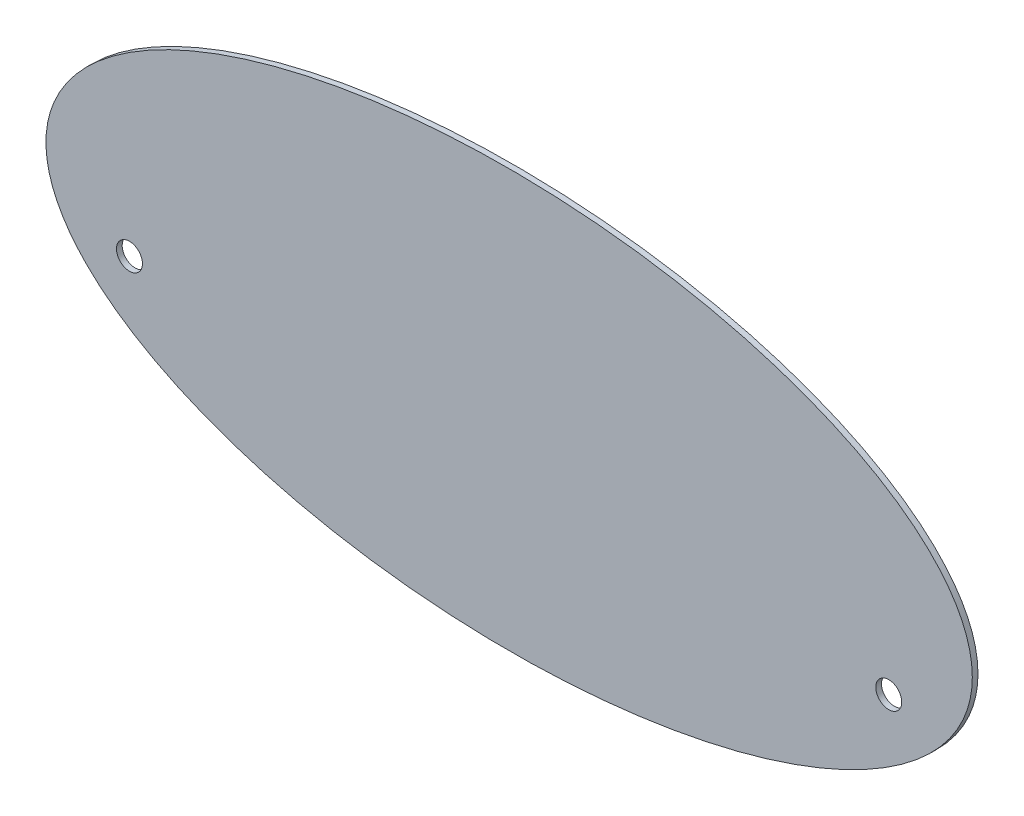
ISO-10303-21;
HEADER;
FILE_DESCRIPTION(('STEP AP214'),'2;1');
FILE_NAME('part.step','',(''),(''),'','','');
FILE_SCHEMA(('AUTOMOTIVE_DESIGN { 1 0 10303 214 1 1 1 1 }'));
ENDSEC;
DATA;
#1=APPLICATION_CONTEXT('core data for automotive mechanical design processes');
#2=APPLICATION_PROTOCOL_DEFINITION('international standard','automotive_design',2000,#1);
#3=PRODUCT_CONTEXT('',#1,'mechanical');
#4=PRODUCT('Part','Part','',(#3));
#5=PRODUCT_RELATED_PRODUCT_CATEGORY('part','',(#4));
#6=PRODUCT_DEFINITION_FORMATION('','',#4);
#7=PRODUCT_DEFINITION_CONTEXT('part definition',#1,'design');
#8=PRODUCT_DEFINITION('design','',#6,#7);
#9=PRODUCT_DEFINITION_SHAPE('','',#8);
#10=(LENGTH_UNIT() NAMED_UNIT(*) SI_UNIT(.MILLI.,.METRE.));
#11=(NAMED_UNIT(*) PLANE_ANGLE_UNIT() SI_UNIT($,.RADIAN.));
#12=(NAMED_UNIT(*) SI_UNIT($,.STERADIAN.) SOLID_ANGLE_UNIT());
#13=UNCERTAINTY_MEASURE_WITH_UNIT(LENGTH_MEASURE(1.E-05),#10,'distance_accuracy_value','');
#14=(GEOMETRIC_REPRESENTATION_CONTEXT(3) GLOBAL_UNCERTAINTY_ASSIGNED_CONTEXT((#13)) GLOBAL_UNIT_ASSIGNED_CONTEXT((#10,
#11,#12)) REPRESENTATION_CONTEXT('',''));
#15=CARTESIAN_POINT('',(0.,0.,0.));
#16=DIRECTION('',(0.,0.,1.));
#17=DIRECTION('',(1.,0.,0.));
#18=AXIS2_PLACEMENT_3D('',#15,#16,#17);
#19=CARTESIAN_POINT('',(0.,0.,3.));
#20=DIRECTION('',(0.,0.,1.));
#21=DIRECTION('',(1.,0.,0.));
#22=AXIS2_PLACEMENT_3D('',#19,#20,#21);
#23=ELLIPSE('',#22,244.,110.);
#24=DIRECTION('',(0.,0.,-1.));
#25=VECTOR('',#24,1.);
#26=SURFACE_OF_LINEAR_EXTRUSION('',#23,#25);
#27=CARTESIAN_POINT('',(244.,0.,3.));
#28=VERTEX_POINT('',#27);
#29=EDGE_CURVE('E10',#28,#28,#23,.T.);
#30=ORIENTED_EDGE('',*,*,#29,.F.);
#31=EDGE_LOOP('',(#30));
#32=FACE_BOUND('',#31,.T.);
#33=CARTESIAN_POINT('',(0.,0.,0.));
#34=DIRECTION('',(0.,0.,1.));
#35=DIRECTION('',(1.,0.,0.));
#36=AXIS2_PLACEMENT_3D('',#33,#34,#35);
#37=ELLIPSE('',#36,244.,110.);
#38=CARTESIAN_POINT('',(244.,0.,0.));
#39=VERTEX_POINT('',#38);
#40=EDGE_CURVE('E41',#39,#39,#37,.T.);
#41=ORIENTED_EDGE('',*,*,#40,.T.);
#42=EDGE_LOOP('',(#41));
#43=FACE_BOUND('',#42,.T.);
#44=ADVANCED_FACE('F33',(#32,#43),#26,.F.);
#45=CARTESIAN_POINT('',(0.,0.,3.));
#46=DIRECTION('',(0.,0.,1.));
#47=DIRECTION('',(1.,0.,0.));
#48=AXIS2_PLACEMENT_3D('',#45,#46,#47);
#49=PLANE('',#48);
#50=CARTESIAN_POINT('',(-200.,-30.,3.));
#51=DIRECTION('',(0.,0.,1.));
#52=DIRECTION('',(1.,0.,0.));
#53=AXIS2_PLACEMENT_3D('',#50,#51,#52);
#54=CIRCLE('',#53,6.83635541999999);
#55=CARTESIAN_POINT('',(-193.16364458,-30.,3.));
#56=VERTEX_POINT('',#55);
#57=EDGE_CURVE('E52',#56,#56,#54,.T.);
#58=ORIENTED_EDGE('',*,*,#57,.F.);
#59=EDGE_LOOP('',(#58));
#60=FACE_BOUND('',#59,.T.);
#61=CARTESIAN_POINT('',(200.,-30.,3.));
#62=DIRECTION('',(0.,0.,1.));
#63=DIRECTION('',(-1.,0.,0.));
#64=AXIS2_PLACEMENT_3D('',#61,#62,#63);
#65=CIRCLE('',#64,6.83635541999999);
#66=CARTESIAN_POINT('',(193.16364458,-30.,3.));
#67=VERTEX_POINT('',#66);
#68=EDGE_CURVE('E48',#67,#67,#65,.T.);
#69=ORIENTED_EDGE('',*,*,#68,.F.);
#70=EDGE_LOOP('',(#69));
#71=FACE_BOUND('',#70,.T.);
#72=ORIENTED_EDGE('',*,*,#29,.T.);
#73=EDGE_LOOP('',(#72));
#74=FACE_BOUND('',#73,.T.);
#75=ADVANCED_FACE('F64',(#60,#71,#74),#49,.T.);
#76=CARTESIAN_POINT('',(0.,0.,0.));
#77=DIRECTION('',(0.,0.,1.));
#78=DIRECTION('',(1.,0.,0.));
#79=AXIS2_PLACEMENT_3D('',#76,#77,#78);
#80=PLANE('',#79);
#81=CARTESIAN_POINT('',(-200.,-30.,0.));
#82=DIRECTION('',(0.,0.,1.));
#83=DIRECTION('',(1.,0.,0.));
#84=AXIS2_PLACEMENT_3D('',#81,#82,#83);
#85=CIRCLE('',#84,6.83635541999999);
#86=CARTESIAN_POINT('',(-193.16364458,-30.,0.));
#87=VERTEX_POINT('',#86);
#88=EDGE_CURVE('E37',#87,#87,#85,.F.);
#89=ORIENTED_EDGE('',*,*,#88,.F.);
#90=EDGE_LOOP('',(#89));
#91=FACE_BOUND('',#90,.T.);
#92=CARTESIAN_POINT('',(200.,-30.,0.));
#93=DIRECTION('',(0.,0.,1.));
#94=DIRECTION('',(1.,0.,0.));
#95=AXIS2_PLACEMENT_3D('',#92,#93,#94);
#96=CIRCLE('',#95,6.83635541999999);
#97=CARTESIAN_POINT('',(206.83635542,-30.,0.));
#98=VERTEX_POINT('',#97);
#99=EDGE_CURVE('E50',#98,#98,#96,.F.);
#100=ORIENTED_EDGE('',*,*,#99,.F.);
#101=EDGE_LOOP('',(#100));
#102=FACE_BOUND('',#101,.T.);
#103=ORIENTED_EDGE('',*,*,#40,.F.);
#104=EDGE_LOOP('',(#103));
#105=FACE_BOUND('',#104,.T.);
#106=ADVANCED_FACE('F66',(#91,#102,#105),#80,.F.);
#107=CARTESIAN_POINT('',(200.,-30.,3.));
#108=DIRECTION('',(0.,0.,-1.));
#109=DIRECTION('',(-1.,0.,0.));
#110=AXIS2_PLACEMENT_3D('',#107,#108,#109);
#111=CYLINDRICAL_SURFACE('',#110,6.83635541999999);
#112=ORIENTED_EDGE('',*,*,#68,.T.);
#113=EDGE_LOOP('',(#112));
#114=FACE_BOUND('',#113,.T.);
#115=ORIENTED_EDGE('',*,*,#99,.T.);
#116=EDGE_LOOP('',(#115));
#117=FACE_BOUND('',#116,.T.);
#118=ADVANCED_FACE('F62',(#114,#117),#111,.F.);
#119=CARTESIAN_POINT('',(-200.,-30.,3.));
#120=DIRECTION('',(0.,0.,-1.));
#121=DIRECTION('',(-1.,0.,0.));
#122=AXIS2_PLACEMENT_3D('',#119,#120,#121);
#123=CYLINDRICAL_SURFACE('',#122,6.83635541999999);
#124=ORIENTED_EDGE('',*,*,#57,.T.);
#125=EDGE_LOOP('',(#124));
#126=FACE_BOUND('',#125,.T.);
#127=ORIENTED_EDGE('',*,*,#88,.T.);
#128=EDGE_LOOP('',(#127));
#129=FACE_BOUND('',#128,.T.);
#130=ADVANCED_FACE('F78',(#126,#129),#123,.F.);
#131=CLOSED_SHELL('',(#44,#75,#106,#118,#130));
#132=MANIFOLD_SOLID_BREP('B2',#131);
#133=ADVANCED_BREP_SHAPE_REPRESENTATION('',(#18,#132),#14);
#134=SHAPE_DEFINITION_REPRESENTATION(#9,#133);
ENDSEC;
END-ISO-10303-21;
